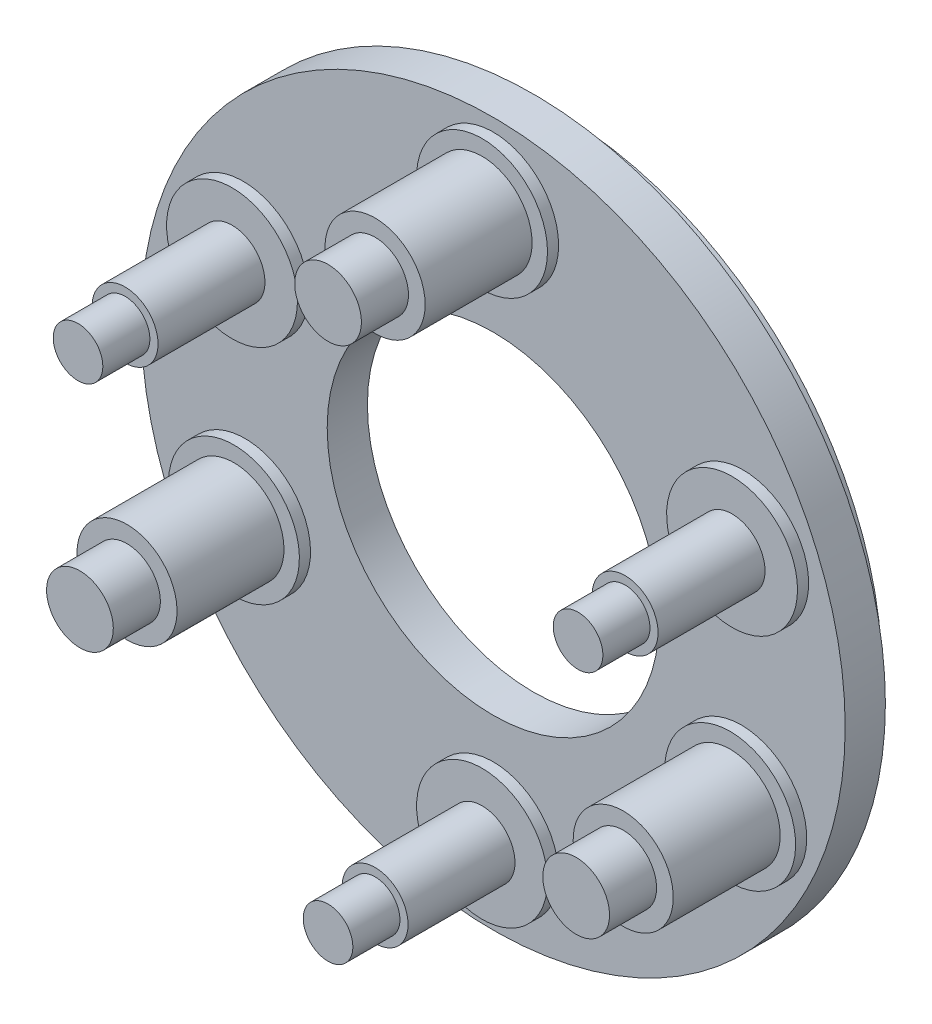
ISO-10303-21;
HEADER;
FILE_DESCRIPTION(('STEP AP214'),'2;1');
FILE_NAME('part.step','',(''),(''),'','','');
FILE_SCHEMA(('AUTOMOTIVE_DESIGN { 1 0 10303 214 1 1 1 1 }'));
ENDSEC;
DATA;
#1=APPLICATION_CONTEXT('core data for automotive mechanical design processes');
#2=APPLICATION_PROTOCOL_DEFINITION('international standard','automotive_design',2000,#1);
#3=PRODUCT_CONTEXT('',#1,'mechanical');
#4=PRODUCT('Part','Part','',(#3));
#5=PRODUCT_RELATED_PRODUCT_CATEGORY('part','',(#4));
#6=PRODUCT_DEFINITION_FORMATION('','',#4);
#7=PRODUCT_DEFINITION_CONTEXT('part definition',#1,'design');
#8=PRODUCT_DEFINITION('design','',#6,#7);
#9=PRODUCT_DEFINITION_SHAPE('','',#8);
#10=(LENGTH_UNIT() NAMED_UNIT(*) SI_UNIT(.MILLI.,.METRE.));
#11=(NAMED_UNIT(*) PLANE_ANGLE_UNIT() SI_UNIT($,.RADIAN.));
#12=(NAMED_UNIT(*) SI_UNIT($,.STERADIAN.) SOLID_ANGLE_UNIT());
#13=UNCERTAINTY_MEASURE_WITH_UNIT(LENGTH_MEASURE(1.E-05),#10,'distance_accuracy_value','');
#14=(GEOMETRIC_REPRESENTATION_CONTEXT(3) GLOBAL_UNCERTAINTY_ASSIGNED_CONTEXT((#13)) GLOBAL_UNIT_ASSIGNED_CONTEXT((#10,
#11,#12)) REPRESENTATION_CONTEXT('',''));
#15=CARTESIAN_POINT('',(0.,0.,0.));
#16=DIRECTION('',(0.,0.,1.));
#17=DIRECTION('',(1.,0.,0.));
#18=AXIS2_PLACEMENT_3D('',#15,#16,#17);
#19=CARTESIAN_POINT('',(0.,0.,0.));
#20=DIRECTION('',(0.,0.,1.));
#21=DIRECTION('',(1.,0.,0.));
#22=AXIS2_PLACEMENT_3D('',#19,#20,#21);
#23=PLANE('',#22);
#24=CARTESIAN_POINT('',(0.,0.,0.));
#25=DIRECTION('',(0.,0.,1.));
#26=DIRECTION('',(1.,0.,0.));
#27=AXIS2_PLACEMENT_3D('',#24,#25,#26);
#28=CIRCLE('',#27,4.9276);
#29=CARTESIAN_POINT('',(4.9276,0.,0.));
#30=VERTEX_POINT('',#29);
#31=EDGE_CURVE('E55',#30,#30,#28,.T.);
#32=ORIENTED_EDGE('',*,*,#31,.T.);
#33=EDGE_LOOP('',(#32));
#34=FACE_BOUND('',#33,.T.);
#35=CARTESIAN_POINT('',(0.,0.,0.));
#36=DIRECTION('',(0.,0.,-1.));
#37=DIRECTION('',(-1.,0.,0.));
#38=AXIS2_PLACEMENT_3D('',#35,#36,#37);
#39=CIRCLE('',#38,8.89);
#40=CARTESIAN_POINT('',(-8.89,0.,0.));
#41=VERTEX_POINT('',#40);
#42=EDGE_CURVE('E64',#41,#41,#39,.T.);
#43=ORIENTED_EDGE('',*,*,#42,.T.);
#44=EDGE_LOOP('',(#43));
#45=FACE_BOUND('',#44,.T.);
#46=ADVANCED_FACE('F37',(#34,#45),#23,.F.);
#47=CARTESIAN_POINT('',(0.,0.,1.1938));
#48=DIRECTION('',(0.,0.,1.));
#49=DIRECTION('',(1.,0.,0.));
#50=AXIS2_PLACEMENT_3D('',#47,#48,#49);
#51=PLANE('',#50);
#52=CARTESIAN_POINT('',(-7.42341139066719,3.15105118570178,1.1938));
#53=DIRECTION('',(0.,0.,1.));
#54=DIRECTION('',(-0.390731128489278,-0.920504853452439,0.));
#55=AXIS2_PLACEMENT_3D('',#52,#53,#54);
#56=CIRCLE('',#55,1.9431);
#57=CARTESIAN_POINT('',(-8.18264104643471,1.36241820495835,1.1938));
#58=VERTEX_POINT('',#57);
#59=EDGE_CURVE('E160',#58,#58,#56,.T.);
#60=ORIENTED_EDGE('',*,*,#59,.F.);
#61=EDGE_LOOP('',(#60));
#62=FACE_BOUND('',#61,.T.);
#63=CARTESIAN_POINT('',(7.42341139066719,3.15105118570178,1.1938));
#64=DIRECTION('',(0.,0.,1.));
#65=DIRECTION('',(-0.390731128489278,0.920504853452439,0.));
#66=AXIS2_PLACEMENT_3D('',#63,#64,#65);
#67=CIRCLE('',#66,1.9431);
#68=CARTESIAN_POINT('',(6.66418173489968,4.93968416644521,1.1938));
#69=VERTEX_POINT('',#68);
#70=EDGE_CURVE('E142',#69,#69,#67,.T.);
#71=ORIENTED_EDGE('',*,*,#70,.F.);
#72=EDGE_LOOP('',(#71));
#73=FACE_BOUND('',#72,.T.);
#74=CARTESIAN_POINT('',(0.,-8.0645,1.1938));
#75=DIRECTION('',(0.,0.,1.));
#76=DIRECTION('',(1.,0.,0.));
#77=AXIS2_PLACEMENT_3D('',#74,#75,#76);
#78=CIRCLE('',#77,1.9431);
#79=CARTESIAN_POINT('',(1.9431,-8.0645,1.1938));
#80=VERTEX_POINT('',#79);
#81=EDGE_CURVE('E124',#80,#80,#78,.T.);
#82=ORIENTED_EDGE('',*,*,#81,.F.);
#83=EDGE_LOOP('',(#82));
#84=FACE_BOUND('',#83,.T.);
#85=CARTESIAN_POINT('',(7.36646969303388,-3.43504123142844,1.1938));
#86=DIRECTION('',(0.,0.,1.));
#87=DIRECTION('',(-0.422618261740703,-0.906307787036648,0.));
#88=AXIS2_PLACEMENT_3D('',#85,#86,#87);
#89=CIRCLE('',#88,1.9431);
#90=CARTESIAN_POINT('',(6.54528014864552,-5.19608789241935,1.1938));
#91=VERTEX_POINT('',#90);
#92=EDGE_CURVE('E106',#91,#91,#89,.T.);
#93=ORIENTED_EDGE('',*,*,#92,.F.);
#94=EDGE_LOOP('',(#93));
#95=FACE_BOUND('',#94,.T.);
#96=CARTESIAN_POINT('',(-7.36646969303388,-3.43504123142844,1.1938));
#97=DIRECTION('',(0.,0.,1.));
#98=DIRECTION('',(-0.422618261740703,0.906307787036648,0.));
#99=AXIS2_PLACEMENT_3D('',#96,#97,#98);
#100=CIRCLE('',#99,1.9431);
#101=CARTESIAN_POINT('',(-8.18765923742224,-1.67399457043753,1.1938));
#102=VERTEX_POINT('',#101);
#103=EDGE_CURVE('E88',#102,#102,#100,.T.);
#104=ORIENTED_EDGE('',*,*,#103,.F.);
#105=EDGE_LOOP('',(#104));
#106=FACE_BOUND('',#105,.T.);
#107=CARTESIAN_POINT('',(0.,8.128,1.1938));
#108=DIRECTION('',(0.,0.,1.));
#109=DIRECTION('',(1.,0.,0.));
#110=AXIS2_PLACEMENT_3D('',#107,#108,#109);
#111=CIRCLE('',#110,1.9431);
#112=CARTESIAN_POINT('',(1.9431,8.128,1.1938));
#113=VERTEX_POINT('',#112);
#114=EDGE_CURVE('E70',#113,#113,#111,.T.);
#115=ORIENTED_EDGE('',*,*,#114,.F.);
#116=EDGE_LOOP('',(#115));
#117=FACE_BOUND('',#116,.T.);
#118=CARTESIAN_POINT('',(0.,0.,1.1938));
#119=DIRECTION('',(0.,0.,1.));
#120=DIRECTION('',(1.,0.,0.));
#121=AXIS2_PLACEMENT_3D('',#118,#119,#120);
#122=CIRCLE('',#121,10.4521);
#123=CARTESIAN_POINT('',(10.4521,0.,1.1938));
#124=VERTEX_POINT('',#123);
#125=EDGE_CURVE('E44',#124,#124,#122,.T.);
#126=ORIENTED_EDGE('',*,*,#125,.T.);
#127=EDGE_LOOP('',(#126));
#128=FACE_BOUND('',#127,.T.);
#129=CARTESIAN_POINT('',(0.,0.,1.1938));
#130=DIRECTION('',(0.,0.,1.));
#131=DIRECTION('',(1.,0.,0.));
#132=AXIS2_PLACEMENT_3D('',#129,#130,#131);
#133=CIRCLE('',#132,4.9276);
#134=CARTESIAN_POINT('',(4.9276,0.,1.1938));
#135=VERTEX_POINT('',#134);
#136=EDGE_CURVE('E53',#135,#135,#133,.T.);
#137=ORIENTED_EDGE('',*,*,#136,.F.);
#138=EDGE_LOOP('',(#137));
#139=FACE_BOUND('',#138,.T.);
#140=ADVANCED_FACE('F211',(#62,#73,#84,#95,#106,#117,#128,#139),#51,.T.);
#141=CARTESIAN_POINT('',(0.,0.,0.));
#142=DIRECTION('',(0.,0.,1.));
#143=DIRECTION('',(1.,0.,0.));
#144=AXIS2_PLACEMENT_3D('',#141,#142,#143);
#145=CIRCLE('',#144,9.6393);
#146=CARTESIAN_POINT('',(9.6393,0.,0.));
#147=VERTEX_POINT('',#146);
#148=EDGE_CURVE('E10',#147,#147,#145,.F.);
#149=ORIENTED_EDGE('',*,*,#148,.F.);
#150=EDGE_LOOP('',(#149));
#151=FACE_BOUND('',#150,.T.);
#152=CARTESIAN_POINT('',(0.,0.,0.));
#153=DIRECTION('',(0.,0.,1.));
#154=DIRECTION('',(1.,0.,0.));
#155=AXIS2_PLACEMENT_3D('',#152,#153,#154);
#156=CIRCLE('',#155,10.4521);
#157=CARTESIAN_POINT('',(10.4521,0.,0.));
#158=VERTEX_POINT('',#157);
#159=EDGE_CURVE('E48',#158,#158,#156,.T.);
#160=ORIENTED_EDGE('',*,*,#159,.F.);
#161=EDGE_LOOP('',(#160));
#162=FACE_BOUND('',#161,.T.);
#163=ADVANCED_FACE('F214',(#151,#162),#23,.F.);
#164=CARTESIAN_POINT('',(0.,0.,1.1938));
#165=DIRECTION('',(0.,0.,-1.));
#166=DIRECTION('',(-1.,0.,0.));
#167=AXIS2_PLACEMENT_3D('',#164,#165,#166);
#168=CYLINDRICAL_SURFACE('',#167,10.4521);
#169=ORIENTED_EDGE('',*,*,#125,.F.);
#170=EDGE_LOOP('',(#169));
#171=FACE_BOUND('',#170,.T.);
#172=ORIENTED_EDGE('',*,*,#159,.T.);
#173=EDGE_LOOP('',(#172));
#174=FACE_BOUND('',#173,.T.);
#175=ADVANCED_FACE('F39',(#171,#174),#168,.T.);
#176=CARTESIAN_POINT('',(0.,0.,1.1938));
#177=DIRECTION('',(0.,0.,-1.));
#178=DIRECTION('',(-1.,0.,0.));
#179=AXIS2_PLACEMENT_3D('',#176,#177,#178);
#180=CYLINDRICAL_SURFACE('',#179,4.9276);
#181=ORIENTED_EDGE('',*,*,#136,.T.);
#182=EDGE_LOOP('',(#181));
#183=FACE_BOUND('',#182,.T.);
#184=ORIENTED_EDGE('',*,*,#31,.F.);
#185=EDGE_LOOP('',(#184));
#186=FACE_BOUND('',#185,.T.);
#187=ADVANCED_FACE('F228',(#183,#186),#180,.F.);
#188=CARTESIAN_POINT('',(0.,0.,-0.7112));
#189=DIRECTION('',(0.,0.,-1.));
#190=DIRECTION('',(-1.,0.,0.));
#191=AXIS2_PLACEMENT_3D('',#188,#189,#190);
#192=PLANE('',#191);
#193=CARTESIAN_POINT('',(0.,0.,-0.7112));
#194=DIRECTION('',(0.,0.,-1.));
#195=DIRECTION('',(-1.,0.,0.));
#196=AXIS2_PLACEMENT_3D('',#193,#194,#195);
#197=CIRCLE('',#196,9.6393);
#198=CARTESIAN_POINT('',(-9.6393,0.,-0.7112));
#199=VERTEX_POINT('',#198);
#200=EDGE_CURVE('E58',#199,#199,#197,.T.);
#201=ORIENTED_EDGE('',*,*,#200,.T.);
#202=EDGE_LOOP('',(#201));
#203=FACE_BOUND('',#202,.T.);
#204=CARTESIAN_POINT('',(0.,0.,-0.7112));
#205=DIRECTION('',(0.,0.,-1.));
#206=DIRECTION('',(-1.,0.,0.));
#207=AXIS2_PLACEMENT_3D('',#204,#205,#206);
#208=CIRCLE('',#207,8.89);
#209=CARTESIAN_POINT('',(-8.89,0.,-0.7112));
#210=VERTEX_POINT('',#209);
#211=EDGE_CURVE('E63',#210,#210,#208,.T.);
#212=ORIENTED_EDGE('',*,*,#211,.F.);
#213=EDGE_LOOP('',(#212));
#214=FACE_BOUND('',#213,.T.);
#215=ADVANCED_FACE('F231',(#203,#214),#192,.T.);
#216=CARTESIAN_POINT('',(0.,0.,-0.7112));
#217=DIRECTION('',(0.,0.,1.));
#218=DIRECTION('',(1.,0.,0.));
#219=AXIS2_PLACEMENT_3D('',#216,#217,#218);
#220=CYLINDRICAL_SURFACE('',#219,9.6393);
#221=ORIENTED_EDGE('',*,*,#200,.F.);
#222=EDGE_LOOP('',(#221));
#223=FACE_BOUND('',#222,.T.);
#224=ORIENTED_EDGE('',*,*,#148,.T.);
#225=EDGE_LOOP('',(#224));
#226=FACE_BOUND('',#225,.T.);
#227=ADVANCED_FACE('F242',(#223,#226),#220,.T.);
#228=CARTESIAN_POINT('',(0.,0.,-0.7112));
#229=DIRECTION('',(0.,0.,1.));
#230=DIRECTION('',(1.,0.,0.));
#231=AXIS2_PLACEMENT_3D('',#228,#229,#230);
#232=CYLINDRICAL_SURFACE('',#231,8.89);
#233=ORIENTED_EDGE('',*,*,#211,.T.);
#234=EDGE_LOOP('',(#233));
#235=FACE_BOUND('',#234,.T.);
#236=ORIENTED_EDGE('',*,*,#42,.F.);
#237=EDGE_LOOP('',(#236));
#238=FACE_BOUND('',#237,.T.);
#239=ADVANCED_FACE('F239',(#235,#238),#232,.F.);
#240=CARTESIAN_POINT('',(0.,8.128,1.524));
#241=DIRECTION('',(0.,0.,-1.));
#242=DIRECTION('',(-1.,0.,0.));
#243=AXIS2_PLACEMENT_3D('',#240,#241,#242);
#244=CYLINDRICAL_SURFACE('',#243,1.9431);
#245=CARTESIAN_POINT('',(0.,8.128,1.524));
#246=DIRECTION('',(0.,0.,1.));
#247=DIRECTION('',(1.,0.,0.));
#248=AXIS2_PLACEMENT_3D('',#245,#246,#247);
#249=CIRCLE('',#248,1.9431);
#250=CARTESIAN_POINT('',(1.9431,8.128,1.524));
#251=VERTEX_POINT('',#250);
#252=EDGE_CURVE('E67',#251,#251,#249,.T.);
#253=ORIENTED_EDGE('',*,*,#252,.F.);
#254=EDGE_LOOP('',(#253));
#255=FACE_BOUND('',#254,.T.);
#256=ORIENTED_EDGE('',*,*,#114,.T.);
#257=EDGE_LOOP('',(#256));
#258=FACE_BOUND('',#257,.T.);
#259=ADVANCED_FACE('F241',(#255,#258),#244,.T.);
#260=CARTESIAN_POINT('',(0.,8.128,1.524));
#261=DIRECTION('',(0.,0.,1.));
#262=DIRECTION('',(1.,0.,0.));
#263=AXIS2_PLACEMENT_3D('',#260,#261,#262);
#264=PLANE('',#263);
#265=CARTESIAN_POINT('',(0.,8.128,1.524));
#266=DIRECTION('',(0.,0.,1.));
#267=DIRECTION('',(1.,0.,0.));
#268=AXIS2_PLACEMENT_3D('',#265,#266,#267);
#269=CIRCLE('',#268,1.4859);
#270=CARTESIAN_POINT('',(1.4859,8.128,1.524));
#271=VERTEX_POINT('',#270);
#272=EDGE_CURVE('E76',#271,#271,#269,.T.);
#273=ORIENTED_EDGE('',*,*,#272,.F.);
#274=EDGE_LOOP('',(#273));
#275=FACE_BOUND('',#274,.T.);
#276=ORIENTED_EDGE('',*,*,#252,.T.);
#277=EDGE_LOOP('',(#276));
#278=FACE_BOUND('',#277,.T.);
#279=ADVANCED_FACE('F249',(#275,#278),#264,.T.);
#280=CARTESIAN_POINT('',(0.,8.128,4.699));
#281=DIRECTION('',(0.,0.,-1.));
#282=DIRECTION('',(-1.,0.,0.));
#283=AXIS2_PLACEMENT_3D('',#280,#281,#282);
#284=CYLINDRICAL_SURFACE('',#283,1.4859);
#285=CARTESIAN_POINT('',(0.,8.128,4.699));
#286=DIRECTION('',(0.,0.,1.));
#287=DIRECTION('',(1.,0.,0.));
#288=AXIS2_PLACEMENT_3D('',#285,#286,#287);
#289=CIRCLE('',#288,1.4859);
#290=CARTESIAN_POINT('',(1.4859,8.128,4.699));
#291=VERTEX_POINT('',#290);
#292=EDGE_CURVE('E73',#291,#291,#289,.T.);
#293=ORIENTED_EDGE('',*,*,#292,.F.);
#294=EDGE_LOOP('',(#293));
#295=FACE_BOUND('',#294,.T.);
#296=ORIENTED_EDGE('',*,*,#272,.T.);
#297=EDGE_LOOP('',(#296));
#298=FACE_BOUND('',#297,.T.);
#299=ADVANCED_FACE('F298',(#295,#298),#284,.T.);
#300=CARTESIAN_POINT('',(0.,8.128,4.699));
#301=DIRECTION('',(0.,0.,1.));
#302=DIRECTION('',(1.,0.,0.));
#303=AXIS2_PLACEMENT_3D('',#300,#301,#302);
#304=PLANE('',#303);
#305=CARTESIAN_POINT('',(0.,8.128,4.699));
#306=DIRECTION('',(0.,0.,1.));
#307=DIRECTION('',(1.,0.,0.));
#308=AXIS2_PLACEMENT_3D('',#305,#306,#307);
#309=CIRCLE('',#308,0.9906);
#310=CARTESIAN_POINT('',(0.9906,8.128,4.699));
#311=VERTEX_POINT('',#310);
#312=EDGE_CURVE('E82',#311,#311,#309,.T.);
#313=ORIENTED_EDGE('',*,*,#312,.F.);
#314=EDGE_LOOP('',(#313));
#315=FACE_BOUND('',#314,.T.);
#316=ORIENTED_EDGE('',*,*,#292,.T.);
#317=EDGE_LOOP('',(#316));
#318=FACE_BOUND('',#317,.T.);
#319=ADVANCED_FACE('F305',(#315,#318),#304,.T.);
#320=CARTESIAN_POINT('',(0.,8.128,6.096));
#321=DIRECTION('',(0.,0.,-1.));
#322=DIRECTION('',(-1.,0.,0.));
#323=AXIS2_PLACEMENT_3D('',#320,#321,#322);
#324=CYLINDRICAL_SURFACE('',#323,0.9906);
#325=CARTESIAN_POINT('',(0.,8.128,6.096));
#326=DIRECTION('',(0.,0.,1.));
#327=DIRECTION('',(1.,0.,0.));
#328=AXIS2_PLACEMENT_3D('',#325,#326,#327);
#329=CIRCLE('',#328,0.9906);
#330=CARTESIAN_POINT('',(0.9906,8.128,6.096));
#331=VERTEX_POINT('',#330);
#332=EDGE_CURVE('E79',#331,#331,#329,.T.);
#333=ORIENTED_EDGE('',*,*,#332,.F.);
#334=EDGE_LOOP('',(#333));
#335=FACE_BOUND('',#334,.T.);
#336=ORIENTED_EDGE('',*,*,#312,.T.);
#337=EDGE_LOOP('',(#336));
#338=FACE_BOUND('',#337,.T.);
#339=ADVANCED_FACE('F313',(#335,#338),#324,.T.);
#340=CARTESIAN_POINT('',(0.,8.128,6.096));
#341=DIRECTION('',(0.,0.,1.));
#342=DIRECTION('',(1.,0.,0.));
#343=AXIS2_PLACEMENT_3D('',#340,#341,#342);
#344=PLANE('',#343);
#345=ORIENTED_EDGE('',*,*,#332,.T.);
#346=EDGE_LOOP('',(#345));
#347=FACE_BOUND('',#346,.T.);
#348=ADVANCED_FACE('F321',(#347),#344,.T.);
#349=CARTESIAN_POINT('',(-7.36646969303388,-3.43504123142844,1.524));
#350=DIRECTION('',(0.,0.,-1.));
#351=DIRECTION('',(-1.,0.,0.));
#352=AXIS2_PLACEMENT_3D('',#349,#350,#351);
#353=CYLINDRICAL_SURFACE('',#352,1.9431);
#354=CARTESIAN_POINT('',(-7.36646969303388,-3.43504123142844,1.524));
#355=DIRECTION('',(0.,0.,1.));
#356=DIRECTION('',(-0.422618261740703,0.906307787036648,0.));
#357=AXIS2_PLACEMENT_3D('',#354,#355,#356);
#358=CIRCLE('',#357,1.9431);
#359=CARTESIAN_POINT('',(-8.18765923742224,-1.67399457043753,1.524));
#360=VERTEX_POINT('',#359);
#361=EDGE_CURVE('E85',#360,#360,#358,.T.);
#362=ORIENTED_EDGE('',*,*,#361,.F.);
#363=EDGE_LOOP('',(#362));
#364=FACE_BOUND('',#363,.T.);
#365=ORIENTED_EDGE('',*,*,#103,.T.);
#366=EDGE_LOOP('',(#365));
#367=FACE_BOUND('',#366,.T.);
#368=ADVANCED_FACE('F329',(#364,#367),#353,.T.);
#369=CARTESIAN_POINT('',(-7.36646969303388,-3.43504123142844,1.524));
#370=DIRECTION('',(0.,0.,1.));
#371=DIRECTION('',(-0.422618261740703,0.906307787036648,0.));
#372=AXIS2_PLACEMENT_3D('',#369,#370,#371);
#373=PLANE('',#372);
#374=CARTESIAN_POINT('',(-7.36646969303388,-3.43504123142844,1.524));
#375=DIRECTION('',(0.,0.,1.));
#376=DIRECTION('',(-0.422618261740703,0.906307787036648,0.));
#377=AXIS2_PLACEMENT_3D('',#374,#375,#376);
#378=CIRCLE('',#377,1.4859);
#379=CARTESIAN_POINT('',(-7.99443816815439,-2.08835849067068,1.524));
#380=VERTEX_POINT('',#379);
#381=EDGE_CURVE('E94',#380,#380,#378,.T.);
#382=ORIENTED_EDGE('',*,*,#381,.F.);
#383=EDGE_LOOP('',(#382));
#384=FACE_BOUND('',#383,.T.);
#385=ORIENTED_EDGE('',*,*,#361,.T.);
#386=EDGE_LOOP('',(#385));
#387=FACE_BOUND('',#386,.T.);
#388=ADVANCED_FACE('F337',(#384,#387),#373,.T.);
#389=CARTESIAN_POINT('',(-7.36646969303388,-3.43504123142844,4.699));
#390=DIRECTION('',(0.,0.,-1.));
#391=DIRECTION('',(-1.,0.,0.));
#392=AXIS2_PLACEMENT_3D('',#389,#390,#391);
#393=CYLINDRICAL_SURFACE('',#392,1.4859);
#394=CARTESIAN_POINT('',(-7.36646969303388,-3.43504123142844,4.699));
#395=DIRECTION('',(0.,0.,1.));
#396=DIRECTION('',(-0.422618261740703,0.906307787036648,0.));
#397=AXIS2_PLACEMENT_3D('',#394,#395,#396);
#398=CIRCLE('',#397,1.4859);
#399=CARTESIAN_POINT('',(-7.99443816815439,-2.08835849067068,4.699));
#400=VERTEX_POINT('',#399);
#401=EDGE_CURVE('E91',#400,#400,#398,.T.);
#402=ORIENTED_EDGE('',*,*,#401,.F.);
#403=EDGE_LOOP('',(#402));
#404=FACE_BOUND('',#403,.T.);
#405=ORIENTED_EDGE('',*,*,#381,.T.);
#406=EDGE_LOOP('',(#405));
#407=FACE_BOUND('',#406,.T.);
#408=ADVANCED_FACE('F345',(#404,#407),#393,.T.);
#409=CARTESIAN_POINT('',(-7.36646969303388,-3.43504123142844,4.699));
#410=DIRECTION('',(0.,0.,1.));
#411=DIRECTION('',(-0.422618261740703,0.906307787036648,0.));
#412=AXIS2_PLACEMENT_3D('',#409,#410,#411);
#413=PLANE('',#412);
#414=CARTESIAN_POINT('',(-7.36646969303388,-3.43504123142844,4.699));
#415=DIRECTION('',(0.,0.,1.));
#416=DIRECTION('',(-0.422618261740703,0.906307787036648,0.));
#417=AXIS2_PLACEMENT_3D('',#414,#415,#416);
#418=CIRCLE('',#417,0.9906);
#419=CARTESIAN_POINT('',(-7.78511534311422,-2.53725273758993,4.699));
#420=VERTEX_POINT('',#419);
#421=EDGE_CURVE('E100',#420,#420,#418,.T.);
#422=ORIENTED_EDGE('',*,*,#421,.F.);
#423=EDGE_LOOP('',(#422));
#424=FACE_BOUND('',#423,.T.);
#425=ORIENTED_EDGE('',*,*,#401,.T.);
#426=EDGE_LOOP('',(#425));
#427=FACE_BOUND('',#426,.T.);
#428=ADVANCED_FACE('F353',(#424,#427),#413,.T.);
#429=CARTESIAN_POINT('',(-7.36646969303388,-3.43504123142844,6.096));
#430=DIRECTION('',(0.,0.,-1.));
#431=DIRECTION('',(-1.,0.,0.));
#432=AXIS2_PLACEMENT_3D('',#429,#430,#431);
#433=CYLINDRICAL_SURFACE('',#432,0.9906);
#434=CARTESIAN_POINT('',(-7.36646969303388,-3.43504123142844,6.096));
#435=DIRECTION('',(0.,0.,1.));
#436=DIRECTION('',(-0.422618261740703,0.906307787036648,0.));
#437=AXIS2_PLACEMENT_3D('',#434,#435,#436);
#438=CIRCLE('',#437,0.9906);
#439=CARTESIAN_POINT('',(-7.78511534311422,-2.53725273758993,6.096));
#440=VERTEX_POINT('',#439);
#441=EDGE_CURVE('E97',#440,#440,#438,.T.);
#442=ORIENTED_EDGE('',*,*,#441,.F.);
#443=EDGE_LOOP('',(#442));
#444=FACE_BOUND('',#443,.T.);
#445=ORIENTED_EDGE('',*,*,#421,.T.);
#446=EDGE_LOOP('',(#445));
#447=FACE_BOUND('',#446,.T.);
#448=ADVANCED_FACE('F361',(#444,#447),#433,.T.);
#449=CARTESIAN_POINT('',(-7.36646969303388,-3.43504123142844,6.096));
#450=DIRECTION('',(0.,0.,1.));
#451=DIRECTION('',(-0.422618261740703,0.906307787036648,0.));
#452=AXIS2_PLACEMENT_3D('',#449,#450,#451);
#453=PLANE('',#452);
#454=ORIENTED_EDGE('',*,*,#441,.T.);
#455=EDGE_LOOP('',(#454));
#456=FACE_BOUND('',#455,.T.);
#457=ADVANCED_FACE('F369',(#456),#453,.T.);
#458=CARTESIAN_POINT('',(7.36646969303388,-3.43504123142844,1.524));
#459=DIRECTION('',(0.,0.,-1.));
#460=DIRECTION('',(-1.,0.,0.));
#461=AXIS2_PLACEMENT_3D('',#458,#459,#460);
#462=CYLINDRICAL_SURFACE('',#461,1.9431);
#463=CARTESIAN_POINT('',(7.36646969303388,-3.43504123142844,1.524));
#464=DIRECTION('',(0.,0.,1.));
#465=DIRECTION('',(-0.422618261740703,-0.906307787036648,0.));
#466=AXIS2_PLACEMENT_3D('',#463,#464,#465);
#467=CIRCLE('',#466,1.9431);
#468=CARTESIAN_POINT('',(6.54528014864552,-5.19608789241935,1.524));
#469=VERTEX_POINT('',#468);
#470=EDGE_CURVE('E103',#469,#469,#467,.T.);
#471=ORIENTED_EDGE('',*,*,#470,.F.);
#472=EDGE_LOOP('',(#471));
#473=FACE_BOUND('',#472,.T.);
#474=ORIENTED_EDGE('',*,*,#92,.T.);
#475=EDGE_LOOP('',(#474));
#476=FACE_BOUND('',#475,.T.);
#477=ADVANCED_FACE('F377',(#473,#476),#462,.T.);
#478=CARTESIAN_POINT('',(7.36646969303388,-3.43504123142844,1.524));
#479=DIRECTION('',(0.,0.,1.));
#480=DIRECTION('',(-0.422618261740703,-0.906307787036648,0.));
#481=AXIS2_PLACEMENT_3D('',#478,#479,#480);
#482=PLANE('',#481);
#483=CARTESIAN_POINT('',(7.36646969303388,-3.43504123142844,1.524));
#484=DIRECTION('',(0.,0.,1.));
#485=DIRECTION('',(-0.422618261740703,-0.906307787036648,0.));
#486=AXIS2_PLACEMENT_3D('',#483,#484,#485);
#487=CIRCLE('',#486,1.4859);
#488=CARTESIAN_POINT('',(6.73850121791336,-4.78172397218619,1.524));
#489=VERTEX_POINT('',#488);
#490=EDGE_CURVE('E112',#489,#489,#487,.T.);
#491=ORIENTED_EDGE('',*,*,#490,.F.);
#492=EDGE_LOOP('',(#491));
#493=FACE_BOUND('',#492,.T.);
#494=ORIENTED_EDGE('',*,*,#470,.T.);
#495=EDGE_LOOP('',(#494));
#496=FACE_BOUND('',#495,.T.);
#497=ADVANCED_FACE('F385',(#493,#496),#482,.T.);
#498=CARTESIAN_POINT('',(7.36646969303388,-3.43504123142844,4.699));
#499=DIRECTION('',(0.,0.,-1.));
#500=DIRECTION('',(-1.,0.,0.));
#501=AXIS2_PLACEMENT_3D('',#498,#499,#500);
#502=CYLINDRICAL_SURFACE('',#501,1.4859);
#503=CARTESIAN_POINT('',(7.36646969303388,-3.43504123142844,4.699));
#504=DIRECTION('',(0.,0.,1.));
#505=DIRECTION('',(-0.422618261740703,-0.906307787036648,0.));
#506=AXIS2_PLACEMENT_3D('',#503,#504,#505);
#507=CIRCLE('',#506,1.4859);
#508=CARTESIAN_POINT('',(6.73850121791336,-4.78172397218619,4.699));
#509=VERTEX_POINT('',#508);
#510=EDGE_CURVE('E109',#509,#509,#507,.T.);
#511=ORIENTED_EDGE('',*,*,#510,.F.);
#512=EDGE_LOOP('',(#511));
#513=FACE_BOUND('',#512,.T.);
#514=ORIENTED_EDGE('',*,*,#490,.T.);
#515=EDGE_LOOP('',(#514));
#516=FACE_BOUND('',#515,.T.);
#517=ADVANCED_FACE('F393',(#513,#516),#502,.T.);
#518=CARTESIAN_POINT('',(7.36646969303388,-3.43504123142844,4.699));
#519=DIRECTION('',(0.,0.,1.));
#520=DIRECTION('',(-0.422618261740703,-0.906307787036648,0.));
#521=AXIS2_PLACEMENT_3D('',#518,#519,#520);
#522=PLANE('',#521);
#523=CARTESIAN_POINT('',(7.36646969303388,-3.43504123142844,4.699));
#524=DIRECTION('',(0.,0.,1.));
#525=DIRECTION('',(-0.422618261740703,-0.906307787036648,0.));
#526=AXIS2_PLACEMENT_3D('',#523,#524,#525);
#527=CIRCLE('',#526,0.9906);
#528=CARTESIAN_POINT('',(6.94782404295354,-4.33282972526694,4.699));
#529=VERTEX_POINT('',#528);
#530=EDGE_CURVE('E118',#529,#529,#527,.T.);
#531=ORIENTED_EDGE('',*,*,#530,.F.);
#532=EDGE_LOOP('',(#531));
#533=FACE_BOUND('',#532,.T.);
#534=ORIENTED_EDGE('',*,*,#510,.T.);
#535=EDGE_LOOP('',(#534));
#536=FACE_BOUND('',#535,.T.);
#537=ADVANCED_FACE('F401',(#533,#536),#522,.T.);
#538=CARTESIAN_POINT('',(7.36646969303388,-3.43504123142844,6.096));
#539=DIRECTION('',(0.,0.,-1.));
#540=DIRECTION('',(-1.,0.,0.));
#541=AXIS2_PLACEMENT_3D('',#538,#539,#540);
#542=CYLINDRICAL_SURFACE('',#541,0.9906);
#543=CARTESIAN_POINT('',(7.36646969303388,-3.43504123142844,6.096));
#544=DIRECTION('',(0.,0.,1.));
#545=DIRECTION('',(-0.422618261740703,-0.906307787036648,0.));
#546=AXIS2_PLACEMENT_3D('',#543,#544,#545);
#547=CIRCLE('',#546,0.9906);
#548=CARTESIAN_POINT('',(6.94782404295354,-4.33282972526694,6.096));
#549=VERTEX_POINT('',#548);
#550=EDGE_CURVE('E115',#549,#549,#547,.T.);
#551=ORIENTED_EDGE('',*,*,#550,.F.);
#552=EDGE_LOOP('',(#551));
#553=FACE_BOUND('',#552,.T.);
#554=ORIENTED_EDGE('',*,*,#530,.T.);
#555=EDGE_LOOP('',(#554));
#556=FACE_BOUND('',#555,.T.);
#557=ADVANCED_FACE('F409',(#553,#556),#542,.T.);
#558=CARTESIAN_POINT('',(7.36646969303388,-3.43504123142844,6.096));
#559=DIRECTION('',(0.,0.,1.));
#560=DIRECTION('',(-0.422618261740703,-0.906307787036648,0.));
#561=AXIS2_PLACEMENT_3D('',#558,#559,#560);
#562=PLANE('',#561);
#563=ORIENTED_EDGE('',*,*,#550,.T.);
#564=EDGE_LOOP('',(#563));
#565=FACE_BOUND('',#564,.T.);
#566=ADVANCED_FACE('F417',(#565),#562,.T.);
#567=CARTESIAN_POINT('',(0.,-8.0645,1.524));
#568=DIRECTION('',(0.,0.,-1.));
#569=DIRECTION('',(-1.,0.,0.));
#570=AXIS2_PLACEMENT_3D('',#567,#568,#569);
#571=CYLINDRICAL_SURFACE('',#570,1.9431);
#572=CARTESIAN_POINT('',(0.,-8.0645,1.524));
#573=DIRECTION('',(0.,0.,1.));
#574=DIRECTION('',(1.,0.,0.));
#575=AXIS2_PLACEMENT_3D('',#572,#573,#574);
#576=CIRCLE('',#575,1.9431);
#577=CARTESIAN_POINT('',(1.9431,-8.0645,1.524));
#578=VERTEX_POINT('',#577);
#579=EDGE_CURVE('E121',#578,#578,#576,.T.);
#580=ORIENTED_EDGE('',*,*,#579,.F.);
#581=EDGE_LOOP('',(#580));
#582=FACE_BOUND('',#581,.T.);
#583=ORIENTED_EDGE('',*,*,#81,.T.);
#584=EDGE_LOOP('',(#583));
#585=FACE_BOUND('',#584,.T.);
#586=ADVANCED_FACE('F425',(#582,#585),#571,.T.);
#587=CARTESIAN_POINT('',(0.,-8.0645,1.524));
#588=DIRECTION('',(0.,0.,1.));
#589=DIRECTION('',(1.,0.,0.));
#590=AXIS2_PLACEMENT_3D('',#587,#588,#589);
#591=PLANE('',#590);
#592=CARTESIAN_POINT('',(0.,-8.0645,1.524));
#593=DIRECTION('',(0.,0.,1.));
#594=DIRECTION('',(1.,0.,0.));
#595=AXIS2_PLACEMENT_3D('',#592,#593,#594);
#596=CIRCLE('',#595,0.9779);
#597=CARTESIAN_POINT('',(0.977900000000001,-8.0645,1.524));
#598=VERTEX_POINT('',#597);
#599=EDGE_CURVE('E130',#598,#598,#596,.T.);
#600=ORIENTED_EDGE('',*,*,#599,.F.);
#601=EDGE_LOOP('',(#600));
#602=FACE_BOUND('',#601,.T.);
#603=ORIENTED_EDGE('',*,*,#579,.T.);
#604=EDGE_LOOP('',(#603));
#605=FACE_BOUND('',#604,.T.);
#606=ADVANCED_FACE('F433',(#602,#605),#591,.T.);
#607=CARTESIAN_POINT('',(0.,-8.0645,4.699));
#608=DIRECTION('',(0.,0.,-1.));
#609=DIRECTION('',(-1.,0.,0.));
#610=AXIS2_PLACEMENT_3D('',#607,#608,#609);
#611=CYLINDRICAL_SURFACE('',#610,0.9779);
#612=CARTESIAN_POINT('',(0.,-8.0645,4.699));
#613=DIRECTION('',(0.,0.,1.));
#614=DIRECTION('',(1.,0.,0.));
#615=AXIS2_PLACEMENT_3D('',#612,#613,#614);
#616=CIRCLE('',#615,0.9779);
#617=CARTESIAN_POINT('',(0.977900000000001,-8.0645,4.699));
#618=VERTEX_POINT('',#617);
#619=EDGE_CURVE('E127',#618,#618,#616,.T.);
#620=ORIENTED_EDGE('',*,*,#619,.F.);
#621=EDGE_LOOP('',(#620));
#622=FACE_BOUND('',#621,.T.);
#623=ORIENTED_EDGE('',*,*,#599,.T.);
#624=EDGE_LOOP('',(#623));
#625=FACE_BOUND('',#624,.T.);
#626=ADVANCED_FACE('F441',(#622,#625),#611,.T.);
#627=CARTESIAN_POINT('',(0.,-8.0645,4.699));
#628=DIRECTION('',(0.,0.,1.));
#629=DIRECTION('',(1.,0.,0.));
#630=AXIS2_PLACEMENT_3D('',#627,#628,#629);
#631=PLANE('',#630);
#632=CARTESIAN_POINT('',(0.,-8.0645,4.699));
#633=DIRECTION('',(0.,0.,1.));
#634=DIRECTION('',(1.,0.,0.));
#635=AXIS2_PLACEMENT_3D('',#632,#633,#634);
#636=CIRCLE('',#635,0.736600000000001);
#637=CARTESIAN_POINT('',(0.736600000000002,-8.0645,4.699));
#638=VERTEX_POINT('',#637);
#639=EDGE_CURVE('E136',#638,#638,#636,.T.);
#640=ORIENTED_EDGE('',*,*,#639,.F.);
#641=EDGE_LOOP('',(#640));
#642=FACE_BOUND('',#641,.T.);
#643=ORIENTED_EDGE('',*,*,#619,.T.);
#644=EDGE_LOOP('',(#643));
#645=FACE_BOUND('',#644,.T.);
#646=ADVANCED_FACE('F449',(#642,#645),#631,.T.);
#647=CARTESIAN_POINT('',(0.,-8.0645,6.096));
#648=DIRECTION('',(0.,0.,-1.));
#649=DIRECTION('',(-1.,0.,0.));
#650=AXIS2_PLACEMENT_3D('',#647,#648,#649);
#651=CYLINDRICAL_SURFACE('',#650,0.736600000000001);
#652=CARTESIAN_POINT('',(0.,-8.0645,6.096));
#653=DIRECTION('',(0.,0.,1.));
#654=DIRECTION('',(1.,0.,0.));
#655=AXIS2_PLACEMENT_3D('',#652,#653,#654);
#656=CIRCLE('',#655,0.736600000000001);
#657=CARTESIAN_POINT('',(0.736600000000002,-8.0645,6.096));
#658=VERTEX_POINT('',#657);
#659=EDGE_CURVE('E133',#658,#658,#656,.T.);
#660=ORIENTED_EDGE('',*,*,#659,.F.);
#661=EDGE_LOOP('',(#660));
#662=FACE_BOUND('',#661,.T.);
#663=ORIENTED_EDGE('',*,*,#639,.T.);
#664=EDGE_LOOP('',(#663));
#665=FACE_BOUND('',#664,.T.);
#666=ADVANCED_FACE('F457',(#662,#665),#651,.T.);
#667=CARTESIAN_POINT('',(0.,-8.0645,6.096));
#668=DIRECTION('',(0.,0.,1.));
#669=DIRECTION('',(1.,0.,0.));
#670=AXIS2_PLACEMENT_3D('',#667,#668,#669);
#671=PLANE('',#670);
#672=ORIENTED_EDGE('',*,*,#659,.T.);
#673=EDGE_LOOP('',(#672));
#674=FACE_BOUND('',#673,.T.);
#675=ADVANCED_FACE('F465',(#674),#671,.T.);
#676=CARTESIAN_POINT('',(7.42341139066719,3.15105118570178,1.524));
#677=DIRECTION('',(0.,0.,-1.));
#678=DIRECTION('',(-1.,0.,0.));
#679=AXIS2_PLACEMENT_3D('',#676,#677,#678);
#680=CYLINDRICAL_SURFACE('',#679,1.9431);
#681=CARTESIAN_POINT('',(7.42341139066719,3.15105118570178,1.524));
#682=DIRECTION('',(0.,0.,1.));
#683=DIRECTION('',(-0.390731128489278,0.920504853452439,0.));
#684=AXIS2_PLACEMENT_3D('',#681,#682,#683);
#685=CIRCLE('',#684,1.9431);
#686=CARTESIAN_POINT('',(6.66418173489968,4.93968416644521,1.524));
#687=VERTEX_POINT('',#686);
#688=EDGE_CURVE('E139',#687,#687,#685,.T.);
#689=ORIENTED_EDGE('',*,*,#688,.F.);
#690=EDGE_LOOP('',(#689));
#691=FACE_BOUND('',#690,.T.);
#692=ORIENTED_EDGE('',*,*,#70,.T.);
#693=EDGE_LOOP('',(#692));
#694=FACE_BOUND('',#693,.T.);
#695=ADVANCED_FACE('F473',(#691,#694),#680,.T.);
#696=CARTESIAN_POINT('',(7.42341139066719,3.15105118570178,1.524));
#697=DIRECTION('',(0.,0.,1.));
#698=DIRECTION('',(-0.390731128489278,0.920504853452439,0.));
#699=AXIS2_PLACEMENT_3D('',#696,#697,#698);
#700=PLANE('',#699);
#701=CARTESIAN_POINT('',(7.42341139066719,3.15105118570178,1.524));
#702=DIRECTION('',(0.,0.,1.));
#703=DIRECTION('',(-0.390731128489278,0.920504853452439,0.));
#704=AXIS2_PLACEMENT_3D('',#701,#702,#703);
#705=CIRCLE('',#704,0.9779);
#706=CARTESIAN_POINT('',(7.04131542011753,4.05121288189292,1.524));
#707=VERTEX_POINT('',#706);
#708=EDGE_CURVE('E148',#707,#707,#705,.T.);
#709=ORIENTED_EDGE('',*,*,#708,.F.);
#710=EDGE_LOOP('',(#709));
#711=FACE_BOUND('',#710,.T.);
#712=ORIENTED_EDGE('',*,*,#688,.T.);
#713=EDGE_LOOP('',(#712));
#714=FACE_BOUND('',#713,.T.);
#715=ADVANCED_FACE('F481',(#711,#714),#700,.T.);
#716=CARTESIAN_POINT('',(7.42341139066719,3.15105118570178,4.699));
#717=DIRECTION('',(0.,0.,-1.));
#718=DIRECTION('',(-1.,0.,0.));
#719=AXIS2_PLACEMENT_3D('',#716,#717,#718);
#720=CYLINDRICAL_SURFACE('',#719,0.9779);
#721=CARTESIAN_POINT('',(7.42341139066719,3.15105118570178,4.699));
#722=DIRECTION('',(0.,0.,1.));
#723=DIRECTION('',(-0.390731128489278,0.920504853452439,0.));
#724=AXIS2_PLACEMENT_3D('',#721,#722,#723);
#725=CIRCLE('',#724,0.9779);
#726=CARTESIAN_POINT('',(7.04131542011753,4.05121288189292,4.699));
#727=VERTEX_POINT('',#726);
#728=EDGE_CURVE('E145',#727,#727,#725,.T.);
#729=ORIENTED_EDGE('',*,*,#728,.F.);
#730=EDGE_LOOP('',(#729));
#731=FACE_BOUND('',#730,.T.);
#732=ORIENTED_EDGE('',*,*,#708,.T.);
#733=EDGE_LOOP('',(#732));
#734=FACE_BOUND('',#733,.T.);
#735=ADVANCED_FACE('F489',(#731,#734),#720,.T.);
#736=CARTESIAN_POINT('',(7.42341139066719,3.15105118570178,4.699));
#737=DIRECTION('',(0.,0.,1.));
#738=DIRECTION('',(-0.390731128489278,0.920504853452439,0.));
#739=AXIS2_PLACEMENT_3D('',#736,#737,#738);
#740=PLANE('',#739);
#741=CARTESIAN_POINT('',(7.42341139066719,3.15105118570178,4.699));
#742=DIRECTION('',(0.,0.,1.));
#743=DIRECTION('',(-0.390731128489278,0.920504853452439,0.));
#744=AXIS2_PLACEMENT_3D('',#741,#742,#743);
#745=CIRCLE('',#744,0.736600000000001);
#746=CARTESIAN_POINT('',(7.13559884142199,3.82909506075485,4.699));
#747=VERTEX_POINT('',#746);
#748=EDGE_CURVE('E154',#747,#747,#745,.T.);
#749=ORIENTED_EDGE('',*,*,#748,.F.);
#750=EDGE_LOOP('',(#749));
#751=FACE_BOUND('',#750,.T.);
#752=ORIENTED_EDGE('',*,*,#728,.T.);
#753=EDGE_LOOP('',(#752));
#754=FACE_BOUND('',#753,.T.);
#755=ADVANCED_FACE('F497',(#751,#754),#740,.T.);
#756=CARTESIAN_POINT('',(7.42341139066719,3.15105118570178,6.096));
#757=DIRECTION('',(0.,0.,-1.));
#758=DIRECTION('',(-1.,0.,0.));
#759=AXIS2_PLACEMENT_3D('',#756,#757,#758);
#760=CYLINDRICAL_SURFACE('',#759,0.736600000000001);
#761=CARTESIAN_POINT('',(7.42341139066719,3.15105118570178,6.096));
#762=DIRECTION('',(0.,0.,1.));
#763=DIRECTION('',(-0.390731128489278,0.920504853452439,0.));
#764=AXIS2_PLACEMENT_3D('',#761,#762,#763);
#765=CIRCLE('',#764,0.736600000000001);
#766=CARTESIAN_POINT('',(7.13559884142199,3.82909506075485,6.096));
#767=VERTEX_POINT('',#766);
#768=EDGE_CURVE('E151',#767,#767,#765,.T.);
#769=ORIENTED_EDGE('',*,*,#768,.F.);
#770=EDGE_LOOP('',(#769));
#771=FACE_BOUND('',#770,.T.);
#772=ORIENTED_EDGE('',*,*,#748,.T.);
#773=EDGE_LOOP('',(#772));
#774=FACE_BOUND('',#773,.T.);
#775=ADVANCED_FACE('F505',(#771,#774),#760,.T.);
#776=CARTESIAN_POINT('',(7.42341139066719,3.15105118570178,6.096));
#777=DIRECTION('',(0.,0.,1.));
#778=DIRECTION('',(-0.390731128489278,0.920504853452439,0.));
#779=AXIS2_PLACEMENT_3D('',#776,#777,#778);
#780=PLANE('',#779);
#781=ORIENTED_EDGE('',*,*,#768,.T.);
#782=EDGE_LOOP('',(#781));
#783=FACE_BOUND('',#782,.T.);
#784=ADVANCED_FACE('F207',(#783),#780,.T.);
#785=CARTESIAN_POINT('',(-7.42341139066719,3.15105118570178,1.524));
#786=DIRECTION('',(0.,0.,-1.));
#787=DIRECTION('',(-1.,0.,0.));
#788=AXIS2_PLACEMENT_3D('',#785,#786,#787);
#789=CYLINDRICAL_SURFACE('',#788,1.9431);
#790=CARTESIAN_POINT('',(-7.42341139066719,3.15105118570178,1.524));
#791=DIRECTION('',(0.,0.,1.));
#792=DIRECTION('',(-0.390731128489278,-0.920504853452439,0.));
#793=AXIS2_PLACEMENT_3D('',#790,#791,#792);
#794=CIRCLE('',#793,1.9431);
#795=CARTESIAN_POINT('',(-8.18264104643471,1.36241820495835,1.524));
#796=VERTEX_POINT('',#795);
#797=EDGE_CURVE('E157',#796,#796,#794,.T.);
#798=ORIENTED_EDGE('',*,*,#797,.F.);
#799=EDGE_LOOP('',(#798));
#800=FACE_BOUND('',#799,.T.);
#801=ORIENTED_EDGE('',*,*,#59,.T.);
#802=EDGE_LOOP('',(#801));
#803=FACE_BOUND('',#802,.T.);
#804=ADVANCED_FACE('F201',(#800,#803),#789,.T.);
#805=CARTESIAN_POINT('',(-7.42341139066719,3.15105118570178,1.524));
#806=DIRECTION('',(0.,0.,1.));
#807=DIRECTION('',(-0.390731128489278,-0.920504853452439,0.));
#808=AXIS2_PLACEMENT_3D('',#805,#806,#807);
#809=PLANE('',#808);
#810=CARTESIAN_POINT('',(-7.42341139066719,3.15105118570178,1.524));
#811=DIRECTION('',(0.,0.,1.));
#812=DIRECTION('',(-0.390731128489278,-0.920504853452439,0.));
#813=AXIS2_PLACEMENT_3D('',#810,#811,#812);
#814=CIRCLE('',#813,0.9779);
#815=CARTESIAN_POINT('',(-7.80550736121686,2.25088948951064,1.524));
#816=VERTEX_POINT('',#815);
#817=EDGE_CURVE('E166',#816,#816,#814,.T.);
#818=ORIENTED_EDGE('',*,*,#817,.F.);
#819=EDGE_LOOP('',(#818));
#820=FACE_BOUND('',#819,.T.);
#821=ORIENTED_EDGE('',*,*,#797,.T.);
#822=EDGE_LOOP('',(#821));
#823=FACE_BOUND('',#822,.T.);
#824=ADVANCED_FACE('F195',(#820,#823),#809,.T.);
#825=CARTESIAN_POINT('',(-7.42341139066719,3.15105118570178,4.699));
#826=DIRECTION('',(0.,0.,-1.));
#827=DIRECTION('',(-1.,0.,0.));
#828=AXIS2_PLACEMENT_3D('',#825,#826,#827);
#829=CYLINDRICAL_SURFACE('',#828,0.9779);
#830=CARTESIAN_POINT('',(-7.42341139066719,3.15105118570178,4.699));
#831=DIRECTION('',(0.,0.,1.));
#832=DIRECTION('',(-0.390731128489278,-0.920504853452439,0.));
#833=AXIS2_PLACEMENT_3D('',#830,#831,#832);
#834=CIRCLE('',#833,0.9779);
#835=CARTESIAN_POINT('',(-7.80550736121686,2.25088948951064,4.699));
#836=VERTEX_POINT('',#835);
#837=EDGE_CURVE('E163',#836,#836,#834,.T.);
#838=ORIENTED_EDGE('',*,*,#837,.F.);
#839=EDGE_LOOP('',(#838));
#840=FACE_BOUND('',#839,.T.);
#841=ORIENTED_EDGE('',*,*,#817,.T.);
#842=EDGE_LOOP('',(#841));
#843=FACE_BOUND('',#842,.T.);
#844=ADVANCED_FACE('F189',(#840,#843),#829,.T.);
#845=CARTESIAN_POINT('',(-7.42341139066719,3.15105118570178,4.699));
#846=DIRECTION('',(0.,0.,1.));
#847=DIRECTION('',(-0.390731128489278,-0.920504853452439,0.));
#848=AXIS2_PLACEMENT_3D('',#845,#846,#847);
#849=PLANE('',#848);
#850=CARTESIAN_POINT('',(-7.42341139066719,3.15105118570178,4.699));
#851=DIRECTION('',(0.,0.,1.));
#852=DIRECTION('',(-0.390731128489278,-0.920504853452439,0.));
#853=AXIS2_PLACEMENT_3D('',#850,#851,#852);
#854=CIRCLE('',#853,0.736600000000001);
#855=CARTESIAN_POINT('',(-7.7112239399124,2.47300731064871,4.699));
#856=VERTEX_POINT('',#855);
#857=EDGE_CURVE('E172',#856,#856,#854,.T.);
#858=ORIENTED_EDGE('',*,*,#857,.F.);
#859=EDGE_LOOP('',(#858));
#860=FACE_BOUND('',#859,.T.);
#861=ORIENTED_EDGE('',*,*,#837,.T.);
#862=EDGE_LOOP('',(#861));
#863=FACE_BOUND('',#862,.T.);
#864=ADVANCED_FACE('F183',(#860,#863),#849,.T.);
#865=CARTESIAN_POINT('',(-7.42341139066719,3.15105118570178,6.096));
#866=DIRECTION('',(0.,0.,-1.));
#867=DIRECTION('',(-1.,0.,0.));
#868=AXIS2_PLACEMENT_3D('',#865,#866,#867);
#869=CYLINDRICAL_SURFACE('',#868,0.736600000000001);
#870=CARTESIAN_POINT('',(-7.42341139066719,3.15105118570178,6.096));
#871=DIRECTION('',(0.,0.,1.));
#872=DIRECTION('',(-0.390731128489278,-0.920504853452439,0.));
#873=AXIS2_PLACEMENT_3D('',#870,#871,#872);
#874=CIRCLE('',#873,0.736600000000001);
#875=CARTESIAN_POINT('',(-7.7112239399124,2.47300731064871,6.096));
#876=VERTEX_POINT('',#875);
#877=EDGE_CURVE('E169',#876,#876,#874,.T.);
#878=ORIENTED_EDGE('',*,*,#877,.F.);
#879=EDGE_LOOP('',(#878));
#880=FACE_BOUND('',#879,.T.);
#881=ORIENTED_EDGE('',*,*,#857,.T.);
#882=EDGE_LOOP('',(#881));
#883=FACE_BOUND('',#882,.T.);
#884=ADVANCED_FACE('F180',(#880,#883),#869,.T.);
#885=CARTESIAN_POINT('',(-7.42341139066719,3.15105118570178,6.096));
#886=DIRECTION('',(0.,0.,1.));
#887=DIRECTION('',(-0.390731128489278,-0.920504853452439,0.));
#888=AXIS2_PLACEMENT_3D('',#885,#886,#887);
#889=PLANE('',#888);
#890=ORIENTED_EDGE('',*,*,#877,.T.);
#891=EDGE_LOOP('',(#890));
#892=FACE_BOUND('',#891,.T.);
#893=ADVANCED_FACE('F178',(#892),#889,.T.);
#894=CLOSED_SHELL('',(#46,#140,#163,#175,#187,#215,#227,#239,#259,#279,#299,#319,#339,#348,#368,
#388,#408,#428,#448,#457,#477,#497,#517,#537,#557,#566,#586,#606,#626,#646,#666,#675,#695,#715,
#735,#755,#775,#784,#804,#824,#844,#864,#884,#893));
#895=MANIFOLD_SOLID_BREP('B2',#894);
#896=ADVANCED_BREP_SHAPE_REPRESENTATION('',(#18,#895),#14);
#897=SHAPE_DEFINITION_REPRESENTATION(#9,#896);
ENDSEC;
END-ISO-10303-21;
